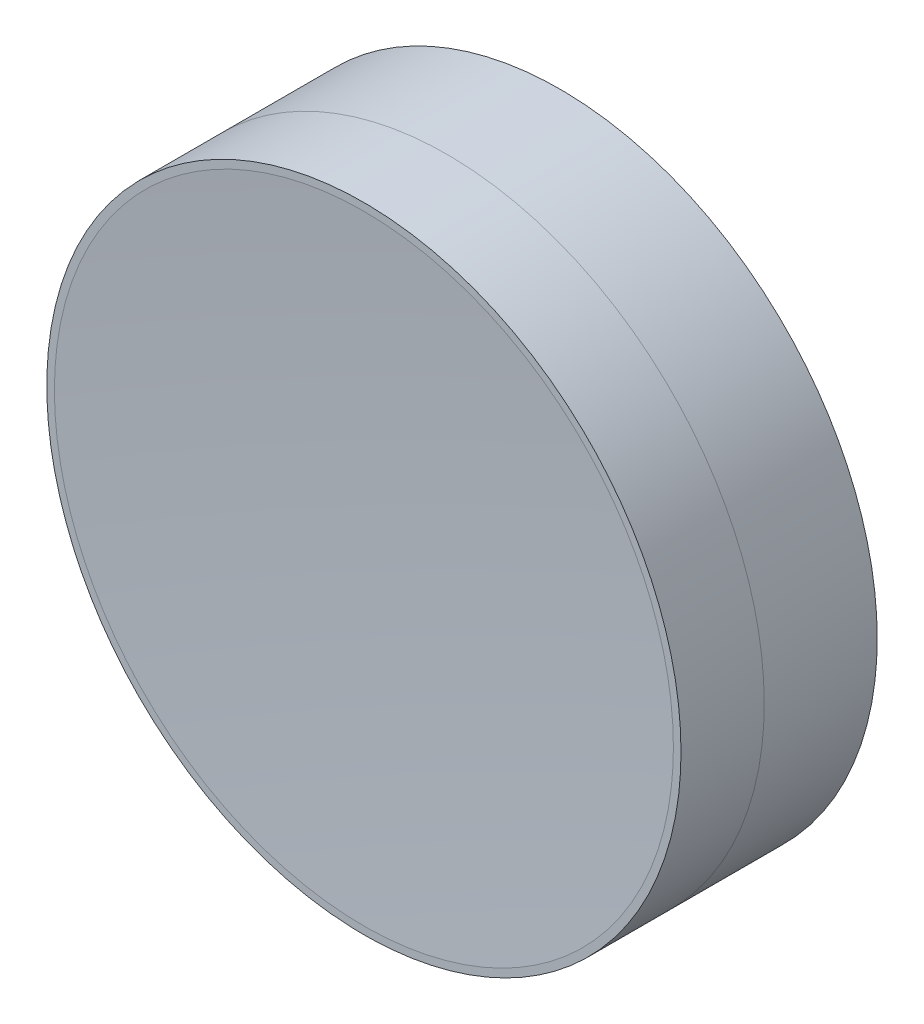
ISO-10303-21;
HEADER;
FILE_DESCRIPTION(('STEP AP214'),'2;1');
FILE_NAME('part.step','',(''),(''),'','','');
FILE_SCHEMA(('AUTOMOTIVE_DESIGN { 1 0 10303 214 1 1 1 1 }'));
ENDSEC;
DATA;
#1=APPLICATION_CONTEXT('core data for automotive mechanical design processes');
#2=APPLICATION_PROTOCOL_DEFINITION('international standard','automotive_design',2000,#1);
#3=PRODUCT_CONTEXT('',#1,'mechanical');
#4=PRODUCT('Part','Part','',(#3));
#5=PRODUCT_RELATED_PRODUCT_CATEGORY('part','',(#4));
#6=PRODUCT_DEFINITION_FORMATION('','',#4);
#7=PRODUCT_DEFINITION_CONTEXT('part definition',#1,'design');
#8=PRODUCT_DEFINITION('design','',#6,#7);
#9=PRODUCT_DEFINITION_SHAPE('','',#8);
#10=(LENGTH_UNIT() NAMED_UNIT(*) SI_UNIT(.MILLI.,.METRE.));
#11=(NAMED_UNIT(*) PLANE_ANGLE_UNIT() SI_UNIT($,.RADIAN.));
#12=(NAMED_UNIT(*) SI_UNIT($,.STERADIAN.) SOLID_ANGLE_UNIT());
#13=UNCERTAINTY_MEASURE_WITH_UNIT(LENGTH_MEASURE(1.E-05),#10,'distance_accuracy_value','');
#14=(GEOMETRIC_REPRESENTATION_CONTEXT(3) GLOBAL_UNCERTAINTY_ASSIGNED_CONTEXT((#13)) GLOBAL_UNIT_ASSIGNED_CONTEXT((#10,
#11,#12)) REPRESENTATION_CONTEXT('',''));
#15=CARTESIAN_POINT('',(0.,0.,0.));
#16=DIRECTION('',(0.,0.,1.));
#17=DIRECTION('',(1.,0.,0.));
#18=AXIS2_PLACEMENT_3D('',#15,#16,#17);
#19=CARTESIAN_POINT('',(0.,0.,-92.3));
#20=DIRECTION('',(1.,0.,0.));
#21=DIRECTION('',(0.,1.,0.));
#22=AXIS2_PLACEMENT_3D('',#19,#20,#21);
#23=SPHERICAL_SURFACE('',#22,92.3);
#24=CARTESIAN_POINT('',(12.2,0.,-0.809836594309236));
#25=CARTESIAN_POINT('',(12.2,12.2,-0.809836594309236));
#26=CARTESIAN_POINT('',(0.,12.2,-0.809836594309236));
#27=CARTESIAN_POINT('',(-12.2,12.2,-0.809836594309236));
#28=CARTESIAN_POINT('',(-12.2,0.,-0.809836594309236));
#29=CARTESIAN_POINT('',(-12.2,-12.2,-0.809836594309236));
#30=CARTESIAN_POINT('',(0.,-12.2,-0.809836594309236));
#31=CARTESIAN_POINT('',(12.2,-12.2,-0.809836594309236));
#32=CARTESIAN_POINT('',(12.2,0.,-0.809836594309236));
#33=(BOUNDED_CURVE() B_SPLINE_CURVE(2,(#24,#25,#26,#27,#28,#29,#30,#31,#32),.UNSPECIFIED.,.T.,
.F.) B_SPLINE_CURVE_WITH_KNOTS((3,2,2,2,3),(0.,1.5707963267949,3.14159265358979,
4.71238898038469,6.28318530717959),
.UNSPECIFIED.) CURVE() GEOMETRIC_REPRESENTATION_ITEM() RATIONAL_B_SPLINE_CURVE((1.,
0.707106781186548,1.,0.707106781186548,1.,0.707106781186548,1.,0.707106781186548,1.)) REPRESENTATION_ITEM(''));
#34=CARTESIAN_POINT('',(12.2,0.,-0.809836594309236));
#35=VERTEX_POINT('',#34);
#36=EDGE_CURVE('P0_E11',#35,#35,#33,.T.);
#37=ORIENTED_EDGE('',*,*,#36,.F.);
#38=EDGE_LOOP('',(#37));
#39=FACE_BOUND('',#38,.T.);
#40=ADVANCED_FACE('P0_F16',(#39),#23,.F.);
#41=CARTESIAN_POINT('',(0.,0.,-0.809836594309236));
#42=DIRECTION('',(0.,0.,-1.));
#43=DIRECTION('',(0.,-1.,0.));
#44=AXIS2_PLACEMENT_3D('',#41,#42,#43);
#45=PLANE('',#44);
#46=CARTESIAN_POINT('',(12.5,0.,-0.809836594309236));
#47=CARTESIAN_POINT('',(12.5,12.5,-0.809836594309236));
#48=CARTESIAN_POINT('',(0.,12.5,-0.809836594309236));
#49=CARTESIAN_POINT('',(-12.5,12.5,-0.809836594309236));
#50=CARTESIAN_POINT('',(-12.5,0.,-0.809836594309236));
#51=CARTESIAN_POINT('',(-12.5,-12.5,-0.809836594309236));
#52=CARTESIAN_POINT('',(0.,-12.5,-0.809836594309236));
#53=CARTESIAN_POINT('',(12.5,-12.5,-0.809836594309236));
#54=CARTESIAN_POINT('',(12.5,0.,-0.809836594309236));
#55=(BOUNDED_CURVE() B_SPLINE_CURVE(2,(#46,#47,#48,#49,#50,#51,#52,#53,#54),.UNSPECIFIED.,.T.,
.F.) B_SPLINE_CURVE_WITH_KNOTS((3,2,2,2,3),(0.,1.5707963267949,3.14159265358979,
4.71238898038469,6.28318530717959),
.UNSPECIFIED.) CURVE() GEOMETRIC_REPRESENTATION_ITEM() RATIONAL_B_SPLINE_CURVE((1.,
0.707106781186548,1.,0.707106781186548,1.,0.707106781186548,1.,0.707106781186548,1.)) REPRESENTATION_ITEM(''));
#56=CARTESIAN_POINT('',(12.5,0.,-0.809836594309236));
#57=VERTEX_POINT('',#56);
#58=EDGE_CURVE('P0_E43',#57,#57,#55,.T.);
#59=ORIENTED_EDGE('',*,*,#58,.F.);
#60=EDGE_LOOP('',(#59));
#61=FACE_BOUND('',#60,.T.);
#62=ORIENTED_EDGE('',*,*,#36,.T.);
#63=EDGE_LOOP('',(#62));
#64=FACE_BOUND('',#63,.T.);
#65=ADVANCED_FACE('P0_F95',(#61,#64),#45,.T.);
#66=CARTESIAN_POINT('',(0.,0.,71.37));
#67=DIRECTION('',(-1.,0.,0.));
#68=DIRECTION('',(0.,1.,0.));
#69=AXIS2_PLACEMENT_3D('',#66,#67,#68);
#70=SPHERICAL_SURFACE('',#69,68.87);
#71=CARTESIAN_POINT('',(12.5,0.,3.6438831764289));
#72=CARTESIAN_POINT('',(12.5,12.5,3.6438831764289));
#73=CARTESIAN_POINT('',(0.,12.5,3.6438831764289));
#74=CARTESIAN_POINT('',(-12.5,12.5,3.6438831764289));
#75=CARTESIAN_POINT('',(-12.5,0.,3.6438831764289));
#76=CARTESIAN_POINT('',(-12.5,-12.5,3.6438831764289));
#77=CARTESIAN_POINT('',(0.,-12.5,3.6438831764289));
#78=CARTESIAN_POINT('',(12.5,-12.5,3.6438831764289));
#79=CARTESIAN_POINT('',(12.5,0.,3.6438831764289));
#80=(BOUNDED_CURVE() B_SPLINE_CURVE(2,(#71,#72,#73,#74,#75,#76,#77,#78,#79),.UNSPECIFIED.,.T.,
.F.) B_SPLINE_CURVE_WITH_KNOTS((3,2,2,2,3),(0.,1.5707963267949,3.14159265358979,
4.71238898038469,6.28318530717959),
.UNSPECIFIED.) CURVE() GEOMETRIC_REPRESENTATION_ITEM() RATIONAL_B_SPLINE_CURVE((1.,
0.707106781186548,1.,0.707106781186548,1.,0.707106781186548,1.,0.707106781186548,1.)) REPRESENTATION_ITEM(''));
#81=CARTESIAN_POINT('',(12.5,0.,3.6438831764289));
#82=VERTEX_POINT('',#81);
#83=EDGE_CURVE('P0_E20',#82,#82,#80,.T.);
#84=ORIENTED_EDGE('',*,*,#83,.T.);
#85=EDGE_LOOP('',(#84));
#86=FACE_BOUND('',#85,.T.);
#87=ADVANCED_FACE('P0_F18',(#86),#70,.F.);
#88=CARTESIAN_POINT('',(0.,0.,-0.809836594309236));
#89=DIRECTION('',(0.,0.,1.));
#90=DIRECTION('',(1.,0.,0.));
#91=AXIS2_PLACEMENT_3D('',#88,#89,#90);
#92=CYLINDRICAL_SURFACE('',#91,12.5);
#93=ORIENTED_EDGE('',*,*,#83,.F.);
#94=CARTESIAN_POINT('',(12.5,0.,-0.809836594309236));
#95=CARTESIAN_POINT('',(12.5,0.,3.6438831764289));
#96=(BOUNDED_CURVE() B_SPLINE_CURVE(1,(#94,#95),.UNSPECIFIED.,.F.,
.F.) B_SPLINE_CURVE_WITH_KNOTS((2,2),(0.,1.),
.UNSPECIFIED.) CURVE() GEOMETRIC_REPRESENTATION_ITEM() RATIONAL_B_SPLINE_CURVE((1.,1.)) REPRESENTATION_ITEM(''));
#97=EDGE_CURVE('P0_E52',#57,#82,#96,.T.);
#98=ORIENTED_EDGE('',*,*,#97,.F.);
#99=ORIENTED_EDGE('',*,*,#58,.T.);
#100=ORIENTED_EDGE('',*,*,#97,.T.);
#101=EDGE_LOOP('',(#93,#98,#99,#100));
#102=FACE_BOUND('',#101,.T.);
#103=ADVANCED_FACE('P0_F51',(#102),#92,.T.);
#104=CLOSED_SHELL('',(#40,#65,#87,#103));
#105=MANIFOLD_SOLID_BREP('P0_B1',#104);
#106=CARTESIAN_POINT('',(0.,0.,71.37));
#107=DIRECTION('',(1.,0.,0.));
#108=DIRECTION('',(0.,-1.,0.));
#109=AXIS2_PLACEMENT_3D('',#106,#107,#108);
#110=SPHERICAL_SURFACE('',#109,68.87);
#111=CARTESIAN_POINT('',(12.5,0.,3.6438831764289));
#112=CARTESIAN_POINT('',(12.5,12.5,3.6438831764289));
#113=CARTESIAN_POINT('',(0.,12.5,3.6438831764289));
#114=CARTESIAN_POINT('',(-12.5,12.5,3.6438831764289));
#115=CARTESIAN_POINT('',(-12.5,0.,3.6438831764289));
#116=CARTESIAN_POINT('',(-12.5,-12.5,3.6438831764289));
#117=CARTESIAN_POINT('',(0.,-12.5,3.6438831764289));
#118=CARTESIAN_POINT('',(12.5,-12.5,3.6438831764289));
#119=CARTESIAN_POINT('',(12.5,0.,3.6438831764289));
#120=(BOUNDED_CURVE() B_SPLINE_CURVE(2,(#111,#112,#113,#114,#115,#116,#117,#118,#119),
.UNSPECIFIED.,.T.,.F.) B_SPLINE_CURVE_WITH_KNOTS((3,2,2,2,3),(0.,1.5707963267949,
3.14159265358979,4.71238898038469,6.28318530717959),
.UNSPECIFIED.) CURVE() GEOMETRIC_REPRESENTATION_ITEM() RATIONAL_B_SPLINE_CURVE((1.,
0.707106781186548,1.,0.707106781186548,1.,0.707106781186548,1.,0.707106781186548,1.)) REPRESENTATION_ITEM(''));
#121=CARTESIAN_POINT('',(12.5,0.,3.6438831764289));
#122=VERTEX_POINT('',#121);
#123=EDGE_CURVE('P1_E39',#122,#122,#120,.T.);
#124=ORIENTED_EDGE('',*,*,#123,.F.);
#125=EDGE_LOOP('',(#124));
#126=FACE_BOUND('',#125,.T.);
#127=ADVANCED_FACE('P1_F16',(#126),#110,.T.);
#128=CARTESIAN_POINT('',(0.,0.,210.71));
#129=DIRECTION('',(-1.,0.,0.));
#130=DIRECTION('',(0.,1.,0.));
#131=AXIS2_PLACEMENT_3D('',#128,#129,#130);
#132=SPHERICAL_SURFACE('',#131,204.15);
#133=CARTESIAN_POINT('',(12.2,0.,6.92486192560557));
#134=CARTESIAN_POINT('',(12.2,12.2,6.92486192560558));
#135=CARTESIAN_POINT('',(0.,12.2,6.92486192560557));
#136=CARTESIAN_POINT('',(-12.2,12.2,6.92486192560558));
#137=CARTESIAN_POINT('',(-12.2,0.,6.92486192560557));
#138=CARTESIAN_POINT('',(-12.2,-12.2,6.92486192560558));
#139=CARTESIAN_POINT('',(0.,-12.2,6.92486192560557));
#140=CARTESIAN_POINT('',(12.2,-12.2,6.92486192560558));
#141=CARTESIAN_POINT('',(12.2,0.,6.92486192560557));
#142=(BOUNDED_CURVE() B_SPLINE_CURVE(2,(#133,#134,#135,#136,#137,#138,#139,#140,#141),
.UNSPECIFIED.,.T.,.F.) B_SPLINE_CURVE_WITH_KNOTS((3,2,2,2,3),(0.,1.5707963267949,
3.14159265358979,4.71238898038469,6.28318530717959),
.UNSPECIFIED.) CURVE() GEOMETRIC_REPRESENTATION_ITEM() RATIONAL_B_SPLINE_CURVE((1.,
0.707106781186548,1.,0.707106781186548,1.,0.707106781186548,1.,0.707106781186548,1.)) REPRESENTATION_ITEM(''));
#143=CARTESIAN_POINT('',(12.2,0.,6.92486192560557));
#144=VERTEX_POINT('',#143);
#145=EDGE_CURVE('P1_E11',#144,#144,#142,.T.);
#146=ORIENTED_EDGE('',*,*,#145,.T.);
#147=EDGE_LOOP('',(#146));
#148=FACE_BOUND('',#147,.T.);
#149=ADVANCED_FACE('P1_F18',(#148),#132,.F.);
#150=CARTESIAN_POINT('',(0.,0.,6.92486192560557));
#151=DIRECTION('',(0.,0.,1.));
#152=DIRECTION('',(1.,0.,0.));
#153=AXIS2_PLACEMENT_3D('',#150,#151,#152);
#154=PLANE('',#153);
#155=CARTESIAN_POINT('',(12.5,0.,6.92486192560557));
#156=CARTESIAN_POINT('',(12.5,12.5,6.92486192560558));
#157=CARTESIAN_POINT('',(0.,12.5,6.92486192560557));
#158=CARTESIAN_POINT('',(-12.5,12.5,6.92486192560558));
#159=CARTESIAN_POINT('',(-12.5,0.,6.92486192560557));
#160=CARTESIAN_POINT('',(-12.5,-12.5,6.92486192560558));
#161=CARTESIAN_POINT('',(0.,-12.5,6.92486192560557));
#162=CARTESIAN_POINT('',(12.5,-12.5,6.92486192560558));
#163=CARTESIAN_POINT('',(12.5,0.,6.92486192560557));
#164=(BOUNDED_CURVE() B_SPLINE_CURVE(2,(#155,#156,#157,#158,#159,#160,#161,#162,#163),
.UNSPECIFIED.,.T.,.F.) B_SPLINE_CURVE_WITH_KNOTS((3,2,2,2,3),(0.,1.5707963267949,
3.14159265358979,4.71238898038469,6.28318530717959),
.UNSPECIFIED.) CURVE() GEOMETRIC_REPRESENTATION_ITEM() RATIONAL_B_SPLINE_CURVE((1.,
0.707106781186548,1.,0.707106781186548,1.,0.707106781186548,1.,0.707106781186548,1.)) REPRESENTATION_ITEM(''));
#165=CARTESIAN_POINT('',(12.5,0.,6.92486192560557));
#166=VERTEX_POINT('',#165);
#167=EDGE_CURVE('P1_E28',#166,#166,#164,.T.);
#168=ORIENTED_EDGE('',*,*,#167,.T.);
#169=EDGE_LOOP('',(#168));
#170=FACE_BOUND('',#169,.T.);
#171=ORIENTED_EDGE('',*,*,#145,.F.);
#172=EDGE_LOOP('',(#171));
#173=FACE_BOUND('',#172,.T.);
#174=ADVANCED_FACE('P1_F91',(#170,#173),#154,.T.);
#175=CARTESIAN_POINT('',(0.,0.,3.6438831764289));
#176=DIRECTION('',(0.,0.,1.));
#177=DIRECTION('',(1.,0.,0.));
#178=AXIS2_PLACEMENT_3D('',#175,#176,#177);
#179=CYLINDRICAL_SURFACE('',#178,12.5);
#180=ORIENTED_EDGE('',*,*,#167,.F.);
#181=CARTESIAN_POINT('',(12.5,0.,3.6438831764289));
#182=CARTESIAN_POINT('',(12.5,0.,6.92486192560557));
#183=(BOUNDED_CURVE() B_SPLINE_CURVE(1,(#181,#182),.UNSPECIFIED.,.F.,
.F.) B_SPLINE_CURVE_WITH_KNOTS((2,2),(0.,1.),
.UNSPECIFIED.) CURVE() GEOMETRIC_REPRESENTATION_ITEM() RATIONAL_B_SPLINE_CURVE((1.,1.)) REPRESENTATION_ITEM(''));
#184=EDGE_CURVE('P1_E52',#122,#166,#183,.T.);
#185=ORIENTED_EDGE('',*,*,#184,.F.);
#186=ORIENTED_EDGE('',*,*,#123,.T.);
#187=ORIENTED_EDGE('',*,*,#184,.T.);
#188=EDGE_LOOP('',(#180,#185,#186,#187));
#189=FACE_BOUND('',#188,.T.);
#190=ADVANCED_FACE('P1_F51',(#189),#179,.T.);
#191=CLOSED_SHELL('',(#127,#149,#174,#190));
#192=MANIFOLD_SOLID_BREP('P1_B1',#191);
#193=ADVANCED_BREP_SHAPE_REPRESENTATION('',(#18,#105,#192),#14);
#194=SHAPE_DEFINITION_REPRESENTATION(#9,#193);
ENDSEC;
END-ISO-10303-21;
